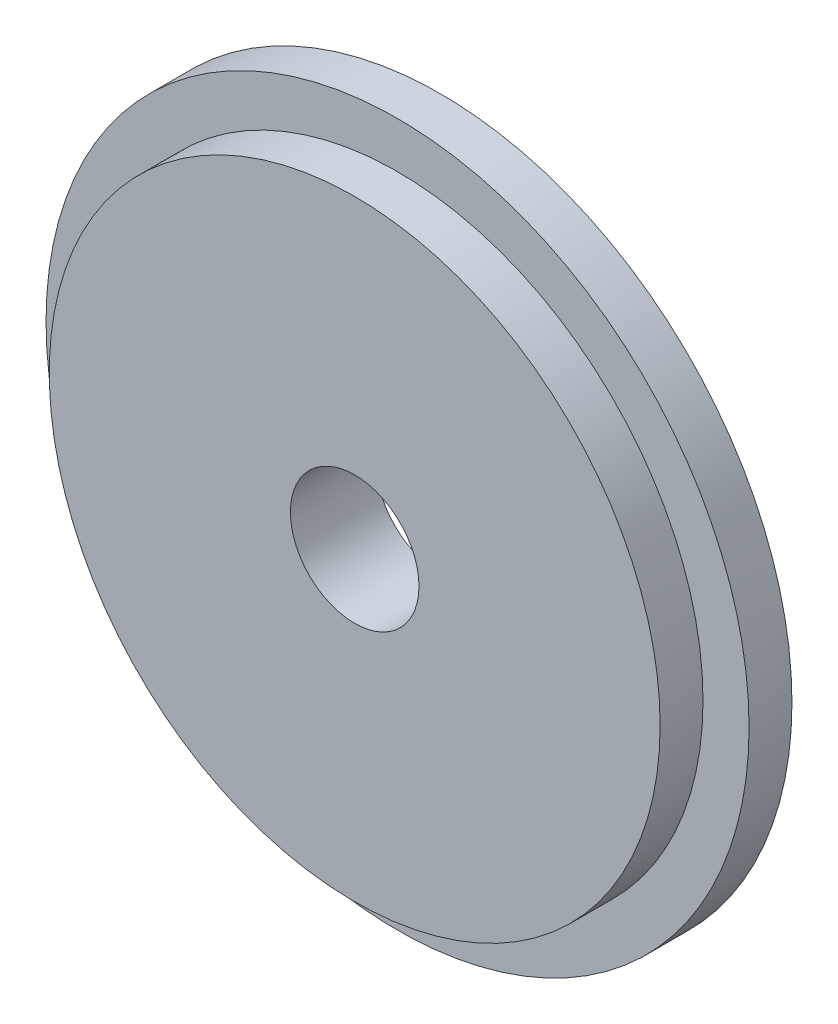
ISO-10303-21;
HEADER;
FILE_DESCRIPTION(('STEP AP214'),'2;1');
FILE_NAME('part.step','',(''),(''),'','','');
FILE_SCHEMA(('AUTOMOTIVE_DESIGN { 1 0 10303 214 1 1 1 1 }'));
ENDSEC;
DATA;
#1=APPLICATION_CONTEXT('core data for automotive mechanical design processes');
#2=APPLICATION_PROTOCOL_DEFINITION('international standard','automotive_design',2000,#1);
#3=PRODUCT_CONTEXT('',#1,'mechanical');
#4=PRODUCT('Part','Part','',(#3));
#5=PRODUCT_RELATED_PRODUCT_CATEGORY('part','',(#4));
#6=PRODUCT_DEFINITION_FORMATION('','',#4);
#7=PRODUCT_DEFINITION_CONTEXT('part definition',#1,'design');
#8=PRODUCT_DEFINITION('design','',#6,#7);
#9=PRODUCT_DEFINITION_SHAPE('','',#8);
#10=(LENGTH_UNIT() NAMED_UNIT(*) SI_UNIT(.MILLI.,.METRE.));
#11=(NAMED_UNIT(*) PLANE_ANGLE_UNIT() SI_UNIT($,.RADIAN.));
#12=(NAMED_UNIT(*) SI_UNIT($,.STERADIAN.) SOLID_ANGLE_UNIT());
#13=UNCERTAINTY_MEASURE_WITH_UNIT(LENGTH_MEASURE(1.E-05),#10,'distance_accuracy_value','');
#14=(GEOMETRIC_REPRESENTATION_CONTEXT(3) GLOBAL_UNCERTAINTY_ASSIGNED_CONTEXT((#13)) GLOBAL_UNIT_ASSIGNED_CONTEXT((#10,
#11,#12)) REPRESENTATION_CONTEXT('',''));
#15=CARTESIAN_POINT('',(0.,0.,0.));
#16=DIRECTION('',(0.,0.,1.));
#17=DIRECTION('',(1.,0.,0.));
#18=AXIS2_PLACEMENT_3D('',#15,#16,#17);
#19=CARTESIAN_POINT('',(0.,0.,2.));
#20=DIRECTION('',(0.,0.,-1.));
#21=DIRECTION('',(-1.,0.,0.));
#22=AXIS2_PLACEMENT_3D('',#19,#20,#21);
#23=CYLINDRICAL_SURFACE('',#22,16.4);
#24=CARTESIAN_POINT('',(0.,0.,2.));
#25=DIRECTION('',(0.,0.,1.));
#26=DIRECTION('',(1.,0.,0.));
#27=AXIS2_PLACEMENT_3D('',#24,#25,#26);
#28=CIRCLE('',#27,16.4);
#29=CARTESIAN_POINT('',(16.4,0.,2.));
#30=VERTEX_POINT('',#29);
#31=EDGE_CURVE('E40',#30,#30,#28,.T.);
#32=ORIENTED_EDGE('',*,*,#31,.F.);
#33=EDGE_LOOP('',(#32));
#34=FACE_BOUND('',#33,.T.);
#35=CARTESIAN_POINT('',(0.,0.,0.));
#36=DIRECTION('',(0.,0.,1.));
#37=DIRECTION('',(1.,0.,0.));
#38=AXIS2_PLACEMENT_3D('',#35,#36,#37);
#39=CIRCLE('',#38,16.4);
#40=CARTESIAN_POINT('',(16.4,0.,0.));
#41=VERTEX_POINT('',#40);
#42=EDGE_CURVE('E36',#41,#41,#39,.T.);
#43=ORIENTED_EDGE('',*,*,#42,.T.);
#44=EDGE_LOOP('',(#43));
#45=FACE_BOUND('',#44,.T.);
#46=ADVANCED_FACE('F33',(#34,#45),#23,.T.);
#47=CARTESIAN_POINT('',(0.,0.,2.));
#48=DIRECTION('',(0.,0.,1.));
#49=DIRECTION('',(1.,0.,0.));
#50=AXIS2_PLACEMENT_3D('',#47,#48,#49);
#51=PLANE('',#50);
#52=CARTESIAN_POINT('',(0.,0.,2.));
#53=DIRECTION('',(0.,0.,1.));
#54=DIRECTION('',(1.,0.,0.));
#55=AXIS2_PLACEMENT_3D('',#52,#53,#54);
#56=CIRCLE('',#55,14.25);
#57=CARTESIAN_POINT('',(14.25,0.,2.));
#58=VERTEX_POINT('',#57);
#59=EDGE_CURVE('E10',#58,#58,#56,.T.);
#60=ORIENTED_EDGE('',*,*,#59,.F.);
#61=EDGE_LOOP('',(#60));
#62=FACE_BOUND('',#61,.T.);
#63=ORIENTED_EDGE('',*,*,#31,.T.);
#64=EDGE_LOOP('',(#63));
#65=FACE_BOUND('',#64,.T.);
#66=ADVANCED_FACE('F77',(#62,#65),#51,.T.);
#67=CARTESIAN_POINT('',(0.,0.,0.));
#68=DIRECTION('',(0.,0.,1.));
#69=DIRECTION('',(1.,0.,0.));
#70=AXIS2_PLACEMENT_3D('',#67,#68,#69);
#71=PLANE('',#70);
#72=CARTESIAN_POINT('',(0.,0.,0.));
#73=DIRECTION('',(0.,0.,1.));
#74=DIRECTION('',(1.,0.,0.));
#75=AXIS2_PLACEMENT_3D('',#72,#73,#74);
#76=CIRCLE('',#75,3.);
#77=CARTESIAN_POINT('',(3.,0.,0.));
#78=VERTEX_POINT('',#77);
#79=EDGE_CURVE('E49',#78,#78,#76,.T.);
#80=ORIENTED_EDGE('',*,*,#79,.T.);
#81=EDGE_LOOP('',(#80));
#82=FACE_BOUND('',#81,.T.);
#83=ORIENTED_EDGE('',*,*,#42,.F.);
#84=EDGE_LOOP('',(#83));
#85=FACE_BOUND('',#84,.T.);
#86=ADVANCED_FACE('F56',(#82,#85),#71,.F.);
#87=CARTESIAN_POINT('',(0.,0.,4.));
#88=DIRECTION('',(0.,0.,-1.));
#89=DIRECTION('',(-1.,0.,0.));
#90=AXIS2_PLACEMENT_3D('',#87,#88,#89);
#91=CYLINDRICAL_SURFACE('',#90,14.25);
#92=CARTESIAN_POINT('',(0.,0.,4.));
#93=DIRECTION('',(0.,0.,1.));
#94=DIRECTION('',(1.,0.,0.));
#95=AXIS2_PLACEMENT_3D('',#92,#93,#94);
#96=CIRCLE('',#95,14.25);
#97=CARTESIAN_POINT('',(14.25,0.,4.));
#98=VERTEX_POINT('',#97);
#99=EDGE_CURVE('E46',#98,#98,#96,.T.);
#100=ORIENTED_EDGE('',*,*,#99,.F.);
#101=EDGE_LOOP('',(#100));
#102=FACE_BOUND('',#101,.T.);
#103=ORIENTED_EDGE('',*,*,#59,.T.);
#104=EDGE_LOOP('',(#103));
#105=FACE_BOUND('',#104,.T.);
#106=ADVANCED_FACE('F68',(#102,#105),#91,.T.);
#107=CARTESIAN_POINT('',(0.,0.,4.));
#108=DIRECTION('',(0.,0.,1.));
#109=DIRECTION('',(1.,0.,0.));
#110=AXIS2_PLACEMENT_3D('',#107,#108,#109);
#111=PLANE('',#110);
#112=CARTESIAN_POINT('',(0.,0.,4.));
#113=DIRECTION('',(0.,0.,1.));
#114=DIRECTION('',(1.,0.,0.));
#115=AXIS2_PLACEMENT_3D('',#112,#113,#114);
#116=CIRCLE('',#115,3.);
#117=CARTESIAN_POINT('',(3.,0.,4.));
#118=VERTEX_POINT('',#117);
#119=EDGE_CURVE('E50',#118,#118,#116,.T.);
#120=ORIENTED_EDGE('',*,*,#119,.F.);
#121=EDGE_LOOP('',(#120));
#122=FACE_BOUND('',#121,.T.);
#123=ORIENTED_EDGE('',*,*,#99,.T.);
#124=EDGE_LOOP('',(#123));
#125=FACE_BOUND('',#124,.T.);
#126=ADVANCED_FACE('F62',(#122,#125),#111,.T.);
#127=CARTESIAN_POINT('',(0.,0.,0.));
#128=DIRECTION('',(0.,0.,1.));
#129=DIRECTION('',(1.,0.,0.));
#130=AXIS2_PLACEMENT_3D('',#127,#128,#129);
#131=CYLINDRICAL_SURFACE('',#130,3.);
#132=ORIENTED_EDGE('',*,*,#79,.F.);
#133=EDGE_LOOP('',(#132));
#134=FACE_BOUND('',#133,.T.);
#135=ORIENTED_EDGE('',*,*,#119,.T.);
#136=EDGE_LOOP('',(#135));
#137=FACE_BOUND('',#136,.T.);
#138=ADVANCED_FACE('F59',(#134,#137),#131,.F.);
#139=CLOSED_SHELL('',(#46,#66,#86,#106,#126,#138));
#140=MANIFOLD_SOLID_BREP('B2',#139);
#141=ADVANCED_BREP_SHAPE_REPRESENTATION('',(#18,#140),#14);
#142=SHAPE_DEFINITION_REPRESENTATION(#9,#141);
ENDSEC;
END-ISO-10303-21;
